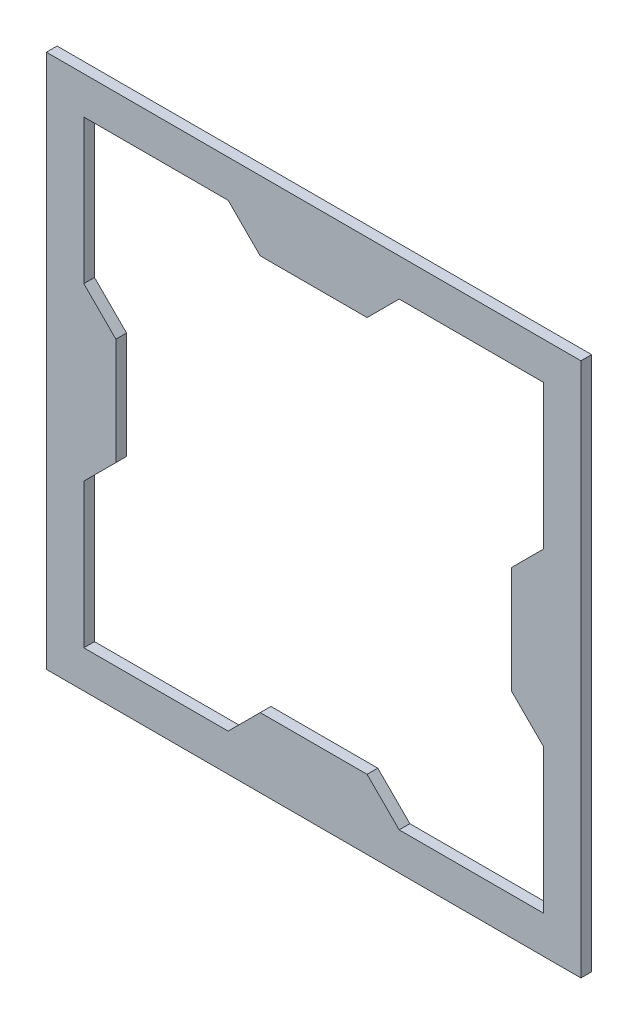
ISO-10303-21;
HEADER;
FILE_DESCRIPTION(('STEP AP214'),'2;1');
FILE_NAME('part.step','',(''),(''),'','','');
FILE_SCHEMA(('AUTOMOTIVE_DESIGN { 1 0 10303 214 1 1 1 1 }'));
ENDSEC;
DATA;
#1=APPLICATION_CONTEXT('core data for automotive mechanical design processes');
#2=APPLICATION_PROTOCOL_DEFINITION('international standard','automotive_design',2000,#1);
#3=PRODUCT_CONTEXT('',#1,'mechanical');
#4=PRODUCT('Part','Part','',(#3));
#5=PRODUCT_RELATED_PRODUCT_CATEGORY('part','',(#4));
#6=PRODUCT_DEFINITION_FORMATION('','',#4);
#7=PRODUCT_DEFINITION_CONTEXT('part definition',#1,'design');
#8=PRODUCT_DEFINITION('design','',#6,#7);
#9=PRODUCT_DEFINITION_SHAPE('','',#8);
#10=(LENGTH_UNIT() NAMED_UNIT(*) SI_UNIT(.MILLI.,.METRE.));
#11=(NAMED_UNIT(*) PLANE_ANGLE_UNIT() SI_UNIT($,.RADIAN.));
#12=(NAMED_UNIT(*) SI_UNIT($,.STERADIAN.) SOLID_ANGLE_UNIT());
#13=UNCERTAINTY_MEASURE_WITH_UNIT(LENGTH_MEASURE(1.E-05),#10,'distance_accuracy_value','');
#14=(GEOMETRIC_REPRESENTATION_CONTEXT(3) GLOBAL_UNCERTAINTY_ASSIGNED_CONTEXT((#13)) GLOBAL_UNIT_ASSIGNED_CONTEXT((#10,
#11,#12)) REPRESENTATION_CONTEXT('',''));
#15=CARTESIAN_POINT('',(0.,0.,0.));
#16=DIRECTION('',(0.,0.,1.));
#17=DIRECTION('',(1.,0.,0.));
#18=AXIS2_PLACEMENT_3D('',#15,#16,#17);
#19=CARTESIAN_POINT('',(0.,-68.2625,3.175));
#20=DIRECTION('',(0.,-1.,0.));
#21=DIRECTION('',(0.,0.,-1.));
#22=AXIS2_PLACEMENT_3D('',#19,#20,#21);
#23=PLANE('',#22);
#24=DIRECTION('',(-1.,0.,0.));
#25=VECTOR('',#24,1.);
#26=CARTESIAN_POINT('',(0.,-68.2625,0.));
#27=LINE('',#26,#25);
#28=CARTESIAN_POINT('',(68.2625,-68.2625,0.));
#29=VERTEX_POINT('',#28);
#30=CARTESIAN_POINT('',(25.3999999999993,-68.2625,0.));
#31=VERTEX_POINT('',#30);
#32=EDGE_CURVE('E241',#29,#31,#27,.T.);
#33=ORIENTED_EDGE('',*,*,#32,.T.);
#34=DIRECTION('',(0.,0.,-1.));
#35=VECTOR('',#34,1.);
#36=CARTESIAN_POINT('',(25.3999999999993,-68.2625,3.175));
#37=LINE('',#36,#35);
#38=CARTESIAN_POINT('',(25.3999999999993,-68.2625,3.175));
#39=VERTEX_POINT('',#38);
#40=EDGE_CURVE('E11',#39,#31,#37,.T.);
#41=ORIENTED_EDGE('',*,*,#40,.F.);
#42=DIRECTION('',(-1.,0.,0.));
#43=VECTOR('',#42,1.);
#44=CARTESIAN_POINT('',(0.,-68.2625,3.175));
#45=LINE('',#44,#43);
#46=CARTESIAN_POINT('',(68.2625,-68.2625,3.175));
#47=VERTEX_POINT('',#46);
#48=EDGE_CURVE('E348',#47,#39,#45,.T.);
#49=ORIENTED_EDGE('',*,*,#48,.F.);
#50=DIRECTION('',(0.,0.,-1.));
#51=VECTOR('',#50,1.);
#52=CARTESIAN_POINT('',(68.2625,-68.2625,3.175));
#53=LINE('',#52,#51);
#54=EDGE_CURVE('E51',#47,#29,#53,.T.);
#55=ORIENTED_EDGE('',*,*,#54,.T.);
#56=EDGE_LOOP('',(#33,#41,#49,#55));
#57=FACE_BOUND('',#56,.T.);
#58=ADVANCED_FACE('F32',(#57),#23,.F.);
#59=CARTESIAN_POINT('',(-21.4312500000002,-21.4312499999999,3.175));
#60=DIRECTION('',(-0.707106781186552,-0.707106781186543,0.));
#61=DIRECTION('',(0.707106781186543,-0.707106781186552,0.));
#62=AXIS2_PLACEMENT_3D('',#59,#60,#61);
#63=PLANE('',#62);
#64=DIRECTION('',(-0.707106781186543,0.707106781186552,0.));
#65=VECTOR('',#64,1.);
#66=CARTESIAN_POINT('',(-21.4312500000002,-21.4312499999999,0.));
#67=LINE('',#66,#65);
#68=CARTESIAN_POINT('',(15.8749999999995,-58.7375,0.));
#69=VERTEX_POINT('',#68);
#70=EDGE_CURVE('E243',#31,#69,#67,.T.);
#71=ORIENTED_EDGE('',*,*,#70,.T.);
#72=DIRECTION('',(0.,0.,-1.));
#73=VECTOR('',#72,1.);
#74=CARTESIAN_POINT('',(15.8749999999995,-58.7375,3.175));
#75=LINE('',#74,#73);
#76=CARTESIAN_POINT('',(15.8749999999995,-58.7375,3.175));
#77=VERTEX_POINT('',#76);
#78=EDGE_CURVE('E42',#77,#69,#75,.T.);
#79=ORIENTED_EDGE('',*,*,#78,.F.);
#80=DIRECTION('',(-0.707106781186543,0.707106781186552,0.));
#81=VECTOR('',#80,1.);
#82=CARTESIAN_POINT('',(-21.4312500000002,-21.4312499999999,3.175));
#83=LINE('',#82,#81);
#84=EDGE_CURVE('E351',#39,#77,#83,.T.);
#85=ORIENTED_EDGE('',*,*,#84,.F.);
#86=ORIENTED_EDGE('',*,*,#40,.T.);
#87=EDGE_LOOP('',(#71,#79,#85,#86));
#88=FACE_BOUND('',#87,.T.);
#89=ADVANCED_FACE('F388',(#88),#63,.F.);
#90=CARTESIAN_POINT('',(0.,-58.7375,3.175));
#91=DIRECTION('',(0.,-1.,0.));
#92=DIRECTION('',(0.,0.,-1.));
#93=AXIS2_PLACEMENT_3D('',#90,#91,#92);
#94=PLANE('',#93);
#95=DIRECTION('',(-1.,0.,0.));
#96=VECTOR('',#95,1.);
#97=CARTESIAN_POINT('',(0.,-58.7375,0.));
#98=LINE('',#97,#96);
#99=CARTESIAN_POINT('',(-15.8750000000005,-58.7375,0.));
#100=VERTEX_POINT('',#99);
#101=EDGE_CURVE('E246',#69,#100,#98,.T.);
#102=ORIENTED_EDGE('',*,*,#101,.T.);
#103=DIRECTION('',(0.,0.,-1.));
#104=VECTOR('',#103,1.);
#105=CARTESIAN_POINT('',(-15.8750000000005,-58.7375,3.175));
#106=LINE('',#105,#104);
#107=CARTESIAN_POINT('',(-15.8750000000005,-58.7375,3.175));
#108=VERTEX_POINT('',#107);
#109=EDGE_CURVE('E317',#108,#100,#106,.T.);
#110=ORIENTED_EDGE('',*,*,#109,.F.);
#111=DIRECTION('',(-1.,0.,0.));
#112=VECTOR('',#111,1.);
#113=CARTESIAN_POINT('',(0.,-58.7375,3.175));
#114=LINE('',#113,#112);
#115=EDGE_CURVE('E358',#77,#108,#114,.T.);
#116=ORIENTED_EDGE('',*,*,#115,.F.);
#117=ORIENTED_EDGE('',*,*,#78,.T.);
#118=EDGE_LOOP('',(#102,#110,#116,#117));
#119=FACE_BOUND('',#118,.T.);
#120=ADVANCED_FACE('F393',(#119),#94,.F.);
#121=CARTESIAN_POINT('',(21.4312499999999,-21.4312500000002,3.175));
#122=DIRECTION('',(0.707106781186542,-0.707106781186553,0.));
#123=DIRECTION('',(0.707106781186553,0.707106781186542,0.));
#124=AXIS2_PLACEMENT_3D('',#121,#122,#123);
#125=PLANE('',#124);
#126=DIRECTION('',(-0.707106781186553,-0.707106781186542,0.));
#127=VECTOR('',#126,1.);
#128=CARTESIAN_POINT('',(21.4312499999999,-21.4312500000002,0.));
#129=LINE('',#128,#127);
#130=CARTESIAN_POINT('',(-25.4000000000006,-68.2625,0.));
#131=VERTEX_POINT('',#130);
#132=EDGE_CURVE('E248',#100,#131,#129,.T.);
#133=ORIENTED_EDGE('',*,*,#132,.T.);
#134=DIRECTION('',(0.,0.,-1.));
#135=VECTOR('',#134,1.);
#136=CARTESIAN_POINT('',(-25.4000000000006,-68.2625,3.175));
#137=LINE('',#136,#135);
#138=CARTESIAN_POINT('',(-25.4000000000006,-68.2625,3.175));
#139=VERTEX_POINT('',#138);
#140=EDGE_CURVE('E314',#139,#131,#137,.T.);
#141=ORIENTED_EDGE('',*,*,#140,.F.);
#142=DIRECTION('',(-0.707106781186553,-0.707106781186542,0.));
#143=VECTOR('',#142,1.);
#144=CARTESIAN_POINT('',(21.4312499999999,-21.4312500000002,3.175));
#145=LINE('',#144,#143);
#146=EDGE_CURVE('E360',#108,#139,#145,.T.);
#147=ORIENTED_EDGE('',*,*,#146,.F.);
#148=ORIENTED_EDGE('',*,*,#109,.T.);
#149=EDGE_LOOP('',(#133,#141,#147,#148));
#150=FACE_BOUND('',#149,.T.);
#151=ADVANCED_FACE('F399',(#150),#125,.F.);
#152=CARTESIAN_POINT('',(-68.2625,-68.2625,0.));
#153=VERTEX_POINT('',#152);
#154=EDGE_CURVE('E244',#131,#153,#27,.T.);
#155=ORIENTED_EDGE('',*,*,#154,.T.);
#156=DIRECTION('',(0.,0.,-1.));
#157=VECTOR('',#156,1.);
#158=CARTESIAN_POINT('',(-68.2625,-68.2625,3.175));
#159=LINE('',#158,#157);
#160=CARTESIAN_POINT('',(-68.2625,-68.2625,3.175));
#161=VERTEX_POINT('',#160);
#162=EDGE_CURVE('E311',#161,#153,#159,.T.);
#163=ORIENTED_EDGE('',*,*,#162,.F.);
#164=EDGE_CURVE('E353',#139,#161,#45,.T.);
#165=ORIENTED_EDGE('',*,*,#164,.F.);
#166=ORIENTED_EDGE('',*,*,#140,.T.);
#167=EDGE_LOOP('',(#155,#163,#165,#166));
#168=FACE_BOUND('',#167,.T.);
#169=ADVANCED_FACE('F403',(#168),#23,.F.);
#170=CARTESIAN_POINT('',(-68.2625,0.,3.175));
#171=DIRECTION('',(-1.,0.,0.));
#172=DIRECTION('',(0.,0.,1.));
#173=AXIS2_PLACEMENT_3D('',#170,#171,#172);
#174=PLANE('',#173);
#175=DIRECTION('',(0.,1.,0.));
#176=VECTOR('',#175,1.);
#177=CARTESIAN_POINT('',(-68.2625,0.,0.));
#178=LINE('',#177,#176);
#179=CARTESIAN_POINT('',(-68.2625,-25.399999999999,0.));
#180=VERTEX_POINT('',#179);
#181=EDGE_CURVE('E250',#153,#180,#178,.T.);
#182=ORIENTED_EDGE('',*,*,#181,.T.);
#183=DIRECTION('',(0.,0.,-1.));
#184=VECTOR('',#183,1.);
#185=CARTESIAN_POINT('',(-68.2625,-25.399999999999,3.175));
#186=LINE('',#185,#184);
#187=CARTESIAN_POINT('',(-68.2625,-25.399999999999,3.175));
#188=VERTEX_POINT('',#187);
#189=EDGE_CURVE('E308',#188,#180,#186,.T.);
#190=ORIENTED_EDGE('',*,*,#189,.F.);
#191=DIRECTION('',(0.,1.,0.));
#192=VECTOR('',#191,1.);
#193=CARTESIAN_POINT('',(-68.2625,0.,3.175));
#194=LINE('',#193,#192);
#195=EDGE_CURVE('E362',#161,#188,#194,.T.);
#196=ORIENTED_EDGE('',*,*,#195,.F.);
#197=ORIENTED_EDGE('',*,*,#162,.T.);
#198=EDGE_LOOP('',(#182,#190,#196,#197));
#199=FACE_BOUND('',#198,.T.);
#200=ADVANCED_FACE('F408',(#199),#174,.F.);
#201=CARTESIAN_POINT('',(-21.4312499999998,21.4312500000002,3.175));
#202=DIRECTION('',(-0.707106781186541,0.707106781186554,0.));
#203=DIRECTION('',(-0.707106781186554,-0.707106781186541,0.));
#204=AXIS2_PLACEMENT_3D('',#201,#202,#203);
#205=PLANE('',#204);
#206=DIRECTION('',(0.707106781186554,0.707106781186541,0.));
#207=VECTOR('',#206,1.);
#208=CARTESIAN_POINT('',(-21.4312499999998,21.4312500000002,0.));
#209=LINE('',#208,#207);
#210=CARTESIAN_POINT('',(-58.7375,-15.8749999999992,0.));
#211=VERTEX_POINT('',#210);
#212=EDGE_CURVE('E252',#180,#211,#209,.T.);
#213=ORIENTED_EDGE('',*,*,#212,.T.);
#214=DIRECTION('',(0.,0.,-1.));
#215=VECTOR('',#214,1.);
#216=CARTESIAN_POINT('',(-58.7375,-15.8749999999992,3.175));
#217=LINE('',#216,#215);
#218=CARTESIAN_POINT('',(-58.7375,-15.8749999999992,3.175));
#219=VERTEX_POINT('',#218);
#220=EDGE_CURVE('E305',#219,#211,#217,.T.);
#221=ORIENTED_EDGE('',*,*,#220,.F.);
#222=DIRECTION('',(0.707106781186554,0.707106781186541,0.));
#223=VECTOR('',#222,1.);
#224=CARTESIAN_POINT('',(-21.4312499999998,21.4312500000002,3.175));
#225=LINE('',#224,#223);
#226=EDGE_CURVE('E364',#188,#219,#225,.T.);
#227=ORIENTED_EDGE('',*,*,#226,.F.);
#228=ORIENTED_EDGE('',*,*,#189,.T.);
#229=EDGE_LOOP('',(#213,#221,#227,#228));
#230=FACE_BOUND('',#229,.T.);
#231=ADVANCED_FACE('F414',(#230),#205,.F.);
#232=CARTESIAN_POINT('',(-58.7375,0.,3.175));
#233=DIRECTION('',(-1.,0.,0.));
#234=DIRECTION('',(0.,0.,1.));
#235=AXIS2_PLACEMENT_3D('',#232,#233,#234);
#236=PLANE('',#235);
#237=DIRECTION('',(0.,1.,0.));
#238=VECTOR('',#237,1.);
#239=CARTESIAN_POINT('',(-58.7375,0.,0.));
#240=LINE('',#239,#238);
#241=CARTESIAN_POINT('',(-58.7375,15.8750000000007,0.));
#242=VERTEX_POINT('',#241);
#243=EDGE_CURVE('E255',#211,#242,#240,.T.);
#244=ORIENTED_EDGE('',*,*,#243,.T.);
#245=DIRECTION('',(0.,0.,-1.));
#246=VECTOR('',#245,1.);
#247=CARTESIAN_POINT('',(-58.7375,15.8750000000007,3.175));
#248=LINE('',#247,#246);
#249=CARTESIAN_POINT('',(-58.7375,15.8750000000007,3.175));
#250=VERTEX_POINT('',#249);
#251=EDGE_CURVE('E302',#250,#242,#248,.T.);
#252=ORIENTED_EDGE('',*,*,#251,.F.);
#253=DIRECTION('',(0.,1.,0.));
#254=VECTOR('',#253,1.);
#255=CARTESIAN_POINT('',(-58.7375,0.,3.175));
#256=LINE('',#255,#254);
#257=EDGE_CURVE('E367',#219,#250,#256,.T.);
#258=ORIENTED_EDGE('',*,*,#257,.F.);
#259=ORIENTED_EDGE('',*,*,#220,.T.);
#260=EDGE_LOOP('',(#244,#252,#258,#259));
#261=FACE_BOUND('',#260,.T.);
#262=ADVANCED_FACE('F418',(#261),#236,.F.);
#263=CARTESIAN_POINT('',(-21.4312500000003,-21.4312499999998,3.175));
#264=DIRECTION('',(-0.707106781186555,-0.70710678118654,0.));
#265=DIRECTION('',(0.70710678118654,-0.707106781186555,0.));
#266=AXIS2_PLACEMENT_3D('',#263,#264,#265);
#267=PLANE('',#266);
#268=DIRECTION('',(-0.70710678118654,0.707106781186555,0.));
#269=VECTOR('',#268,1.);
#270=CARTESIAN_POINT('',(-21.4312500000003,-21.4312499999998,0.));
#271=LINE('',#270,#269);
#272=CARTESIAN_POINT('',(-68.2625,25.4000000000009,0.));
#273=VERTEX_POINT('',#272);
#274=EDGE_CURVE('E257',#242,#273,#271,.T.);
#275=ORIENTED_EDGE('',*,*,#274,.T.);
#276=DIRECTION('',(0.,0.,-1.));
#277=VECTOR('',#276,1.);
#278=CARTESIAN_POINT('',(-68.2625,25.4000000000009,3.175));
#279=LINE('',#278,#277);
#280=CARTESIAN_POINT('',(-68.2625,25.4000000000009,3.175));
#281=VERTEX_POINT('',#280);
#282=EDGE_CURVE('E299',#281,#273,#279,.T.);
#283=ORIENTED_EDGE('',*,*,#282,.F.);
#284=DIRECTION('',(-0.70710678118654,0.707106781186555,0.));
#285=VECTOR('',#284,1.);
#286=CARTESIAN_POINT('',(-21.4312500000003,-21.4312499999998,3.175));
#287=LINE('',#286,#285);
#288=EDGE_CURVE('E369',#250,#281,#287,.T.);
#289=ORIENTED_EDGE('',*,*,#288,.F.);
#290=ORIENTED_EDGE('',*,*,#251,.T.);
#291=EDGE_LOOP('',(#275,#283,#289,#290));
#292=FACE_BOUND('',#291,.T.);
#293=ADVANCED_FACE('F423',(#292),#267,.F.);
#294=CARTESIAN_POINT('',(-68.2625,68.2625,0.));
#295=VERTEX_POINT('',#294);
#296=EDGE_CURVE('E253',#273,#295,#178,.T.);
#297=ORIENTED_EDGE('',*,*,#296,.T.);
#298=DIRECTION('',(0.,0.,-1.));
#299=VECTOR('',#298,1.);
#300=CARTESIAN_POINT('',(-68.2625,68.2625,3.175));
#301=LINE('',#300,#299);
#302=CARTESIAN_POINT('',(-68.2625,68.2625,3.175));
#303=VERTEX_POINT('',#302);
#304=EDGE_CURVE('E297',#303,#295,#301,.T.);
#305=ORIENTED_EDGE('',*,*,#304,.F.);
#306=EDGE_CURVE('E365',#281,#303,#194,.T.);
#307=ORIENTED_EDGE('',*,*,#306,.F.);
#308=ORIENTED_EDGE('',*,*,#282,.T.);
#309=EDGE_LOOP('',(#297,#305,#307,#308));
#310=FACE_BOUND('',#309,.T.);
#311=ADVANCED_FACE('F429',(#310),#174,.F.);
#312=CARTESIAN_POINT('',(0.,68.2625,3.175));
#313=DIRECTION('',(0.,-1.,0.));
#314=DIRECTION('',(0.,0.,-1.));
#315=AXIS2_PLACEMENT_3D('',#312,#313,#314);
#316=PLANE('',#315);
#317=DIRECTION('',(-1.,0.,0.));
#318=VECTOR('',#317,1.);
#319=CARTESIAN_POINT('',(0.,68.2625,0.));
#320=LINE('',#319,#318);
#321=CARTESIAN_POINT('',(-25.4,68.2625,0.));
#322=VERTEX_POINT('',#321);
#323=EDGE_CURVE('E259',#322,#295,#320,.T.);
#324=ORIENTED_EDGE('',*,*,#323,.F.);
#325=DIRECTION('',(0.,0.,-1.));
#326=VECTOR('',#325,1.);
#327=CARTESIAN_POINT('',(-25.4,68.2625,3.175));
#328=LINE('',#327,#326);
#329=CARTESIAN_POINT('',(-25.4,68.2625,3.175));
#330=VERTEX_POINT('',#329);
#331=EDGE_CURVE('E295',#330,#322,#328,.T.);
#332=ORIENTED_EDGE('',*,*,#331,.F.);
#333=DIRECTION('',(-1.,0.,0.));
#334=VECTOR('',#333,1.);
#335=CARTESIAN_POINT('',(0.,68.2625,3.175));
#336=LINE('',#335,#334);
#337=EDGE_CURVE('E371',#330,#303,#336,.T.);
#338=ORIENTED_EDGE('',*,*,#337,.T.);
#339=ORIENTED_EDGE('',*,*,#304,.T.);
#340=EDGE_LOOP('',(#324,#332,#338,#339));
#341=FACE_BOUND('',#340,.T.);
#342=ADVANCED_FACE('F433',(#341),#316,.T.);
#343=CARTESIAN_POINT('',(21.43125,21.43125,3.175));
#344=DIRECTION('',(0.707106781186547,0.707106781186548,0.));
#345=DIRECTION('',(-0.707106781186548,0.707106781186547,0.));
#346=AXIS2_PLACEMENT_3D('',#343,#344,#345);
#347=PLANE('',#346);
#348=DIRECTION('',(0.707106781186548,-0.707106781186547,0.));
#349=VECTOR('',#348,1.);
#350=CARTESIAN_POINT('',(21.43125,21.43125,0.));
#351=LINE('',#350,#349);
#352=CARTESIAN_POINT('',(-15.875,58.7375,0.));
#353=VERTEX_POINT('',#352);
#354=EDGE_CURVE('E262',#322,#353,#351,.T.);
#355=ORIENTED_EDGE('',*,*,#354,.T.);
#356=DIRECTION('',(0.,0.,-1.));
#357=VECTOR('',#356,1.);
#358=CARTESIAN_POINT('',(-15.875,58.7375,3.175));
#359=LINE('',#358,#357);
#360=CARTESIAN_POINT('',(-15.875,58.7375,3.175));
#361=VERTEX_POINT('',#360);
#362=EDGE_CURVE('E293',#361,#353,#359,.T.);
#363=ORIENTED_EDGE('',*,*,#362,.F.);
#364=DIRECTION('',(0.707106781186548,-0.707106781186547,0.));
#365=VECTOR('',#364,1.);
#366=CARTESIAN_POINT('',(21.43125,21.43125,3.175));
#367=LINE('',#366,#365);
#368=EDGE_CURVE('E374',#330,#361,#367,.T.);
#369=ORIENTED_EDGE('',*,*,#368,.F.);
#370=ORIENTED_EDGE('',*,*,#331,.T.);
#371=EDGE_LOOP('',(#355,#363,#369,#370));
#372=FACE_BOUND('',#371,.T.);
#373=ADVANCED_FACE('F438',(#372),#347,.F.);
#374=CARTESIAN_POINT('',(0.,58.7375,3.175));
#375=DIRECTION('',(0.,-1.,0.));
#376=DIRECTION('',(0.,0.,-1.));
#377=AXIS2_PLACEMENT_3D('',#374,#375,#376);
#378=PLANE('',#377);
#379=DIRECTION('',(-1.,0.,0.));
#380=VECTOR('',#379,1.);
#381=CARTESIAN_POINT('',(0.,58.7375,0.));
#382=LINE('',#381,#380);
#383=CARTESIAN_POINT('',(15.875,58.7375,0.));
#384=VERTEX_POINT('',#383);
#385=EDGE_CURVE('E266',#384,#353,#382,.T.);
#386=ORIENTED_EDGE('',*,*,#385,.F.);
#387=DIRECTION('',(0.,0.,-1.));
#388=VECTOR('',#387,1.);
#389=CARTESIAN_POINT('',(15.875,58.7375,3.175));
#390=LINE('',#389,#388);
#391=CARTESIAN_POINT('',(15.875,58.7375,3.175));
#392=VERTEX_POINT('',#391);
#393=EDGE_CURVE('E291',#392,#384,#390,.T.);
#394=ORIENTED_EDGE('',*,*,#393,.F.);
#395=DIRECTION('',(-1.,0.,0.));
#396=VECTOR('',#395,1.);
#397=CARTESIAN_POINT('',(0.,58.7375,3.175));
#398=LINE('',#397,#396);
#399=EDGE_CURVE('E377',#392,#361,#398,.T.);
#400=ORIENTED_EDGE('',*,*,#399,.T.);
#401=ORIENTED_EDGE('',*,*,#362,.T.);
#402=EDGE_LOOP('',(#386,#394,#400,#401));
#403=FACE_BOUND('',#402,.T.);
#404=ADVANCED_FACE('F445',(#403),#378,.T.);
#405=CARTESIAN_POINT('',(-21.43125,21.43125,3.175));
#406=DIRECTION('',(-0.707106781186547,0.707106781186548,0.));
#407=DIRECTION('',(-0.707106781186548,-0.707106781186547,0.));
#408=AXIS2_PLACEMENT_3D('',#405,#406,#407);
#409=PLANE('',#408);
#410=DIRECTION('',(0.707106781186548,0.707106781186547,0.));
#411=VECTOR('',#410,1.);
#412=CARTESIAN_POINT('',(-21.43125,21.43125,0.));
#413=LINE('',#412,#411);
#414=CARTESIAN_POINT('',(25.4,68.2625,0.));
#415=VERTEX_POINT('',#414);
#416=EDGE_CURVE('E269',#384,#415,#413,.T.);
#417=ORIENTED_EDGE('',*,*,#416,.T.);
#418=DIRECTION('',(0.,0.,-1.));
#419=VECTOR('',#418,1.);
#420=CARTESIAN_POINT('',(25.4,68.2625,3.175));
#421=LINE('',#420,#419);
#422=CARTESIAN_POINT('',(25.4,68.2625,3.175));
#423=VERTEX_POINT('',#422);
#424=EDGE_CURVE('E289',#423,#415,#421,.T.);
#425=ORIENTED_EDGE('',*,*,#424,.F.);
#426=DIRECTION('',(0.707106781186548,0.707106781186547,0.));
#427=VECTOR('',#426,1.);
#428=CARTESIAN_POINT('',(-21.43125,21.43125,3.175));
#429=LINE('',#428,#427);
#430=EDGE_CURVE('E380',#392,#423,#429,.T.);
#431=ORIENTED_EDGE('',*,*,#430,.F.);
#432=ORIENTED_EDGE('',*,*,#393,.T.);
#433=EDGE_LOOP('',(#417,#425,#431,#432));
#434=FACE_BOUND('',#433,.T.);
#435=ADVANCED_FACE('F448',(#434),#409,.F.);
#436=CARTESIAN_POINT('',(68.2625,68.2625,0.));
#437=VERTEX_POINT('',#436);
#438=EDGE_CURVE('E263',#437,#415,#320,.T.);
#439=ORIENTED_EDGE('',*,*,#438,.F.);
#440=DIRECTION('',(0.,0.,-1.));
#441=VECTOR('',#440,1.);
#442=CARTESIAN_POINT('',(68.2625,68.2625,3.175));
#443=LINE('',#442,#441);
#444=CARTESIAN_POINT('',(68.2625,68.2625,3.175));
#445=VERTEX_POINT('',#444);
#446=EDGE_CURVE('E287',#445,#437,#443,.T.);
#447=ORIENTED_EDGE('',*,*,#446,.F.);
#448=EDGE_CURVE('E375',#445,#423,#336,.T.);
#449=ORIENTED_EDGE('',*,*,#448,.T.);
#450=ORIENTED_EDGE('',*,*,#424,.T.);
#451=EDGE_LOOP('',(#439,#447,#449,#450));
#452=FACE_BOUND('',#451,.T.);
#453=ADVANCED_FACE('F452',(#452),#316,.T.);
#454=CARTESIAN_POINT('',(68.2625,0.,3.175));
#455=DIRECTION('',(-1.,0.,0.));
#456=DIRECTION('',(0.,0.,1.));
#457=AXIS2_PLACEMENT_3D('',#454,#455,#456);
#458=PLANE('',#457);
#459=DIRECTION('',(0.,1.,0.));
#460=VECTOR('',#459,1.);
#461=CARTESIAN_POINT('',(68.2625,0.,0.));
#462=LINE('',#461,#460);
#463=CARTESIAN_POINT('',(68.2625,25.3999999999997,0.));
#464=VERTEX_POINT('',#463);
#465=EDGE_CURVE('E272',#464,#437,#462,.T.);
#466=ORIENTED_EDGE('',*,*,#465,.F.);
#467=DIRECTION('',(0.,0.,-1.));
#468=VECTOR('',#467,1.);
#469=CARTESIAN_POINT('',(68.2625,25.3999999999997,3.175));
#470=LINE('',#469,#468);
#471=CARTESIAN_POINT('',(68.2625,25.3999999999997,3.175));
#472=VERTEX_POINT('',#471);
#473=EDGE_CURVE('E285',#472,#464,#470,.T.);
#474=ORIENTED_EDGE('',*,*,#473,.F.);
#475=DIRECTION('',(0.,1.,0.));
#476=VECTOR('',#475,1.);
#477=CARTESIAN_POINT('',(68.2625,0.,3.175));
#478=LINE('',#477,#476);
#479=EDGE_CURVE('E226',#472,#445,#478,.T.);
#480=ORIENTED_EDGE('',*,*,#479,.T.);
#481=ORIENTED_EDGE('',*,*,#446,.T.);
#482=EDGE_LOOP('',(#466,#474,#480,#481));
#483=FACE_BOUND('',#482,.T.);
#484=ADVANCED_FACE('F454',(#483),#458,.T.);
#485=CARTESIAN_POINT('',(21.43125,-21.4312500000001,3.175));
#486=DIRECTION('',(0.707106781186545,-0.707106781186549,0.));
#487=DIRECTION('',(0.70710678118655,0.707106781186545,0.));
#488=AXIS2_PLACEMENT_3D('',#485,#486,#487);
#489=PLANE('',#488);
#490=DIRECTION('',(-0.70710678118655,-0.707106781186546,0.));
#491=VECTOR('',#490,1.);
#492=CARTESIAN_POINT('',(21.43125,-21.4312500000001,0.));
#493=LINE('',#492,#491);
#494=CARTESIAN_POINT('',(58.7375000000001,15.8749999999998,0.));
#495=VERTEX_POINT('',#494);
#496=EDGE_CURVE('E275',#464,#495,#493,.T.);
#497=ORIENTED_EDGE('',*,*,#496,.T.);
#498=DIRECTION('',(0.,0.,-1.));
#499=VECTOR('',#498,1.);
#500=CARTESIAN_POINT('',(58.7375000000001,15.8749999999998,3.175));
#501=LINE('',#500,#499);
#502=CARTESIAN_POINT('',(58.7375000000001,15.8749999999998,3.175));
#503=VERTEX_POINT('',#502);
#504=EDGE_CURVE('E211',#503,#495,#501,.T.);
#505=ORIENTED_EDGE('',*,*,#504,.F.);
#506=DIRECTION('',(-0.70710678118655,-0.707106781186546,0.));
#507=VECTOR('',#506,1.);
#508=CARTESIAN_POINT('',(21.43125,-21.4312500000001,3.175));
#509=LINE('',#508,#507);
#510=EDGE_CURVE('E223',#472,#503,#509,.T.);
#511=ORIENTED_EDGE('',*,*,#510,.F.);
#512=ORIENTED_EDGE('',*,*,#473,.T.);
#513=EDGE_LOOP('',(#497,#505,#511,#512));
#514=FACE_BOUND('',#513,.T.);
#515=ADVANCED_FACE('F457',(#514),#489,.F.);
#516=CARTESIAN_POINT('',(58.7375,0.,3.175));
#517=DIRECTION('',(-1.,0.,0.));
#518=DIRECTION('',(0.,0.,1.));
#519=AXIS2_PLACEMENT_3D('',#516,#517,#518);
#520=PLANE('',#519);
#521=DIRECTION('',(0.,1.,0.));
#522=VECTOR('',#521,1.);
#523=CARTESIAN_POINT('',(58.7375,0.,0.));
#524=LINE('',#523,#522);
#525=CARTESIAN_POINT('',(58.7375,-15.8750000000003,0.));
#526=VERTEX_POINT('',#525);
#527=EDGE_CURVE('E208',#526,#495,#524,.T.);
#528=ORIENTED_EDGE('',*,*,#527,.F.);
#529=DIRECTION('',(0.,0.,-1.));
#530=VECTOR('',#529,1.);
#531=CARTESIAN_POINT('',(58.7375,-15.8750000000003,3.175));
#532=LINE('',#531,#530);
#533=CARTESIAN_POINT('',(58.7375,-15.8750000000003,3.175));
#534=VERTEX_POINT('',#533);
#535=EDGE_CURVE('E202',#534,#526,#532,.T.);
#536=ORIENTED_EDGE('',*,*,#535,.F.);
#537=DIRECTION('',(0.,1.,0.));
#538=VECTOR('',#537,1.);
#539=CARTESIAN_POINT('',(58.7375,0.,3.175));
#540=LINE('',#539,#538);
#541=EDGE_CURVE('E206',#534,#503,#540,.T.);
#542=ORIENTED_EDGE('',*,*,#541,.T.);
#543=ORIENTED_EDGE('',*,*,#504,.T.);
#544=EDGE_LOOP('',(#528,#536,#542,#543));
#545=FACE_BOUND('',#544,.T.);
#546=ADVANCED_FACE('F204',(#545),#520,.T.);
#547=CARTESIAN_POINT('',(21.4312500000001,21.4312499999999,3.175));
#548=DIRECTION('',(0.70710678118655,0.707106781186545,0.));
#549=DIRECTION('',(-0.707106781186545,0.70710678118655,0.));
#550=AXIS2_PLACEMENT_3D('',#547,#548,#549);
#551=PLANE('',#550);
#552=DIRECTION('',(0.707106781186545,-0.70710678118655,0.));
#553=VECTOR('',#552,1.);
#554=CARTESIAN_POINT('',(21.4312500000001,21.4312499999999,0.));
#555=LINE('',#554,#553);
#556=CARTESIAN_POINT('',(68.2625,-25.4000000000003,0.));
#557=VERTEX_POINT('',#556);
#558=EDGE_CURVE('E280',#526,#557,#555,.T.);
#559=ORIENTED_EDGE('',*,*,#558,.T.);
#560=DIRECTION('',(0.,0.,-1.));
#561=VECTOR('',#560,1.);
#562=CARTESIAN_POINT('',(68.2625,-25.4000000000003,3.175));
#563=LINE('',#562,#561);
#564=CARTESIAN_POINT('',(68.2625,-25.4000000000003,3.175));
#565=VERTEX_POINT('',#564);
#566=EDGE_CURVE('E126',#565,#557,#563,.T.);
#567=ORIENTED_EDGE('',*,*,#566,.F.);
#568=DIRECTION('',(0.707106781186545,-0.70710678118655,0.));
#569=VECTOR('',#568,1.);
#570=CARTESIAN_POINT('',(21.4312500000001,21.4312499999999,3.175));
#571=LINE('',#570,#569);
#572=EDGE_CURVE('E213',#534,#565,#571,.T.);
#573=ORIENTED_EDGE('',*,*,#572,.F.);
#574=ORIENTED_EDGE('',*,*,#535,.T.);
#575=EDGE_LOOP('',(#559,#567,#573,#574));
#576=FACE_BOUND('',#575,.T.);
#577=ADVANCED_FACE('F214',(#576),#551,.F.);
#578=CARTESIAN_POINT('',(-79.375,0.,3.175));
#579=DIRECTION('',(-1.,0.,0.));
#580=DIRECTION('',(0.,0.,1.));
#581=AXIS2_PLACEMENT_3D('',#578,#579,#580);
#582=PLANE('',#581);
#583=DIRECTION('',(0.,1.,0.));
#584=VECTOR('',#583,1.);
#585=CARTESIAN_POINT('',(-79.375,0.,0.));
#586=LINE('',#585,#584);
#587=CARTESIAN_POINT('',(-79.375,-79.375,0.));
#588=VERTEX_POINT('',#587);
#589=CARTESIAN_POINT('',(-79.375,79.375,0.));
#590=VERTEX_POINT('',#589);
#591=EDGE_CURVE('E230',#588,#590,#586,.T.);
#592=ORIENTED_EDGE('',*,*,#591,.F.);
#593=DIRECTION('',(0.,0.,-1.));
#594=VECTOR('',#593,1.);
#595=CARTESIAN_POINT('',(-79.375,-79.375,3.175));
#596=LINE('',#595,#594);
#597=CARTESIAN_POINT('',(-79.375,-79.375,3.175));
#598=VERTEX_POINT('',#597);
#599=EDGE_CURVE('E36',#598,#588,#596,.T.);
#600=ORIENTED_EDGE('',*,*,#599,.F.);
#601=DIRECTION('',(0.,1.,0.));
#602=VECTOR('',#601,1.);
#603=CARTESIAN_POINT('',(-79.375,0.,3.175));
#604=LINE('',#603,#602);
#605=CARTESIAN_POINT('',(-79.375,79.375,3.175));
#606=VERTEX_POINT('',#605);
#607=EDGE_CURVE('E506',#598,#606,#604,.T.);
#608=ORIENTED_EDGE('',*,*,#607,.T.);
#609=DIRECTION('',(0.,0.,-1.));
#610=VECTOR('',#609,1.);
#611=CARTESIAN_POINT('',(-79.375,79.375,3.175));
#612=LINE('',#611,#610);
#613=EDGE_CURVE('E322',#606,#590,#612,.T.);
#614=ORIENTED_EDGE('',*,*,#613,.T.);
#615=EDGE_LOOP('',(#592,#600,#608,#614));
#616=FACE_BOUND('',#615,.T.);
#617=ADVANCED_FACE('F34',(#616),#582,.T.);
#618=CARTESIAN_POINT('',(0.,-79.375,3.175));
#619=DIRECTION('',(0.,-1.,0.));
#620=DIRECTION('',(1.,0.,0.));
#621=AXIS2_PLACEMENT_3D('',#618,#619,#620);
#622=PLANE('',#621);
#623=DIRECTION('',(-1.,0.,0.));
#624=VECTOR('',#623,1.);
#625=CARTESIAN_POINT('',(0.,-79.375,0.));
#626=LINE('',#625,#624);
#627=CARTESIAN_POINT('',(79.375,-79.375,0.));
#628=VERTEX_POINT('',#627);
#629=EDGE_CURVE('E233',#628,#588,#626,.T.);
#630=ORIENTED_EDGE('',*,*,#629,.F.);
#631=DIRECTION('',(0.,0.,-1.));
#632=VECTOR('',#631,1.);
#633=CARTESIAN_POINT('',(79.375,-79.375,3.175));
#634=LINE('',#633,#632);
#635=CARTESIAN_POINT('',(79.375,-79.375,3.175));
#636=VERTEX_POINT('',#635);
#637=EDGE_CURVE('E326',#636,#628,#634,.T.);
#638=ORIENTED_EDGE('',*,*,#637,.F.);
#639=DIRECTION('',(-1.,0.,0.));
#640=VECTOR('',#639,1.);
#641=CARTESIAN_POINT('',(0.,-79.375,3.175));
#642=LINE('',#641,#640);
#643=EDGE_CURVE('E335',#636,#598,#642,.T.);
#644=ORIENTED_EDGE('',*,*,#643,.T.);
#645=ORIENTED_EDGE('',*,*,#599,.T.);
#646=EDGE_LOOP('',(#630,#638,#644,#645));
#647=FACE_BOUND('',#646,.T.);
#648=ADVANCED_FACE('F333',(#647),#622,.T.);
#649=CARTESIAN_POINT('',(79.375,0.,3.175));
#650=DIRECTION('',(-1.,0.,0.));
#651=DIRECTION('',(0.,0.,1.));
#652=AXIS2_PLACEMENT_3D('',#649,#650,#651);
#653=PLANE('',#652);
#654=DIRECTION('',(0.,1.,0.));
#655=VECTOR('',#654,1.);
#656=CARTESIAN_POINT('',(79.375,0.,0.));
#657=LINE('',#656,#655);
#658=CARTESIAN_POINT('',(79.375,79.375,0.));
#659=VERTEX_POINT('',#658);
#660=EDGE_CURVE('E236',#628,#659,#657,.T.);
#661=ORIENTED_EDGE('',*,*,#660,.T.);
#662=DIRECTION('',(0.,0.,-1.));
#663=VECTOR('',#662,1.);
#664=CARTESIAN_POINT('',(79.375,79.375,3.175));
#665=LINE('',#664,#663);
#666=CARTESIAN_POINT('',(79.375,79.375,3.175));
#667=VERTEX_POINT('',#666);
#668=EDGE_CURVE('E324',#667,#659,#665,.T.);
#669=ORIENTED_EDGE('',*,*,#668,.F.);
#670=DIRECTION('',(0.,1.,0.));
#671=VECTOR('',#670,1.);
#672=CARTESIAN_POINT('',(79.375,0.,3.175));
#673=LINE('',#672,#671);
#674=EDGE_CURVE('E349',#636,#667,#673,.T.);
#675=ORIENTED_EDGE('',*,*,#674,.F.);
#676=ORIENTED_EDGE('',*,*,#637,.T.);
#677=EDGE_LOOP('',(#661,#669,#675,#676));
#678=FACE_BOUND('',#677,.T.);
#679=ADVANCED_FACE('F342',(#678),#653,.F.);
#680=CARTESIAN_POINT('',(0.,79.375,3.175));
#681=DIRECTION('',(0.,-1.,0.));
#682=DIRECTION('',(1.,0.,0.));
#683=AXIS2_PLACEMENT_3D('',#680,#681,#682);
#684=PLANE('',#683);
#685=DIRECTION('',(-1.,0.,0.));
#686=VECTOR('',#685,1.);
#687=CARTESIAN_POINT('',(0.,79.375,0.));
#688=LINE('',#687,#686);
#689=EDGE_CURVE('E238',#659,#590,#688,.T.);
#690=ORIENTED_EDGE('',*,*,#689,.T.);
#691=ORIENTED_EDGE('',*,*,#613,.F.);
#692=DIRECTION('',(-1.,0.,0.));
#693=VECTOR('',#692,1.);
#694=CARTESIAN_POINT('',(0.,79.375,3.175));
#695=LINE('',#694,#693);
#696=EDGE_CURVE('E346',#667,#606,#695,.T.);
#697=ORIENTED_EDGE('',*,*,#696,.F.);
#698=ORIENTED_EDGE('',*,*,#668,.T.);
#699=EDGE_LOOP('',(#690,#691,#697,#698));
#700=FACE_BOUND('',#699,.T.);
#701=ADVANCED_FACE('F345',(#700),#684,.F.);
#702=EDGE_CURVE('E276',#29,#557,#462,.T.);
#703=ORIENTED_EDGE('',*,*,#702,.F.);
#704=ORIENTED_EDGE('',*,*,#54,.F.);
#705=EDGE_CURVE('E217',#47,#565,#478,.T.);
#706=ORIENTED_EDGE('',*,*,#705,.T.);
#707=ORIENTED_EDGE('',*,*,#566,.T.);
#708=EDGE_LOOP('',(#703,#704,#706,#707));
#709=FACE_BOUND('',#708,.T.);
#710=ADVANCED_FACE('F384',(#709),#458,.T.);
#711=CARTESIAN_POINT('',(0.,0.,3.175));
#712=DIRECTION('',(0.,0.,1.));
#713=DIRECTION('',(1.,0.,0.));
#714=AXIS2_PLACEMENT_3D('',#711,#712,#713);
#715=PLANE('',#714);
#716=ORIENTED_EDGE('',*,*,#607,.F.);
#717=ORIENTED_EDGE('',*,*,#643,.F.);
#718=ORIENTED_EDGE('',*,*,#674,.T.);
#719=ORIENTED_EDGE('',*,*,#696,.T.);
#720=EDGE_LOOP('',(#716,#717,#718,#719));
#721=FACE_BOUND('',#720,.T.);
#722=ORIENTED_EDGE('',*,*,#48,.T.);
#723=ORIENTED_EDGE('',*,*,#84,.T.);
#724=ORIENTED_EDGE('',*,*,#115,.T.);
#725=ORIENTED_EDGE('',*,*,#146,.T.);
#726=ORIENTED_EDGE('',*,*,#164,.T.);
#727=ORIENTED_EDGE('',*,*,#195,.T.);
#728=ORIENTED_EDGE('',*,*,#226,.T.);
#729=ORIENTED_EDGE('',*,*,#257,.T.);
#730=ORIENTED_EDGE('',*,*,#288,.T.);
#731=ORIENTED_EDGE('',*,*,#306,.T.);
#732=ORIENTED_EDGE('',*,*,#337,.F.);
#733=ORIENTED_EDGE('',*,*,#368,.T.);
#734=ORIENTED_EDGE('',*,*,#399,.F.);
#735=ORIENTED_EDGE('',*,*,#430,.T.);
#736=ORIENTED_EDGE('',*,*,#448,.F.);
#737=ORIENTED_EDGE('',*,*,#479,.F.);
#738=ORIENTED_EDGE('',*,*,#510,.T.);
#739=ORIENTED_EDGE('',*,*,#541,.F.);
#740=ORIENTED_EDGE('',*,*,#572,.T.);
#741=ORIENTED_EDGE('',*,*,#705,.F.);
#742=EDGE_LOOP('',(#722,#723,#724,#725,#726,#727,#728,#729,#730,#731,#732,#733,#734,#735,#736,
#737,#738,#739,#740,#741));
#743=FACE_BOUND('',#742,.T.);
#744=ADVANCED_FACE('F220',(#721,#743),#715,.T.);
#745=CARTESIAN_POINT('',(0.,0.,0.));
#746=DIRECTION('',(0.,0.,1.));
#747=DIRECTION('',(1.,0.,0.));
#748=AXIS2_PLACEMENT_3D('',#745,#746,#747);
#749=PLANE('',#748);
#750=ORIENTED_EDGE('',*,*,#591,.T.);
#751=ORIENTED_EDGE('',*,*,#689,.F.);
#752=ORIENTED_EDGE('',*,*,#660,.F.);
#753=ORIENTED_EDGE('',*,*,#629,.T.);
#754=EDGE_LOOP('',(#750,#751,#752,#753));
#755=FACE_BOUND('',#754,.T.);
#756=ORIENTED_EDGE('',*,*,#32,.F.);
#757=ORIENTED_EDGE('',*,*,#702,.T.);
#758=ORIENTED_EDGE('',*,*,#558,.F.);
#759=ORIENTED_EDGE('',*,*,#527,.T.);
#760=ORIENTED_EDGE('',*,*,#496,.F.);
#761=ORIENTED_EDGE('',*,*,#465,.T.);
#762=ORIENTED_EDGE('',*,*,#438,.T.);
#763=ORIENTED_EDGE('',*,*,#416,.F.);
#764=ORIENTED_EDGE('',*,*,#385,.T.);
#765=ORIENTED_EDGE('',*,*,#354,.F.);
#766=ORIENTED_EDGE('',*,*,#323,.T.);
#767=ORIENTED_EDGE('',*,*,#296,.F.);
#768=ORIENTED_EDGE('',*,*,#274,.F.);
#769=ORIENTED_EDGE('',*,*,#243,.F.);
#770=ORIENTED_EDGE('',*,*,#212,.F.);
#771=ORIENTED_EDGE('',*,*,#181,.F.);
#772=ORIENTED_EDGE('',*,*,#154,.F.);
#773=ORIENTED_EDGE('',*,*,#132,.F.);
#774=ORIENTED_EDGE('',*,*,#101,.F.);
#775=ORIENTED_EDGE('',*,*,#70,.F.);
#776=EDGE_LOOP('',(#756,#757,#758,#759,#760,#761,#762,#763,#764,#765,#766,#767,#768,#769,#770,
#771,#772,#773,#774,#775));
#777=FACE_BOUND('',#776,.T.);
#778=ADVANCED_FACE('F339',(#755,#777),#749,.F.);
#779=CLOSED_SHELL('',(#58,#89,#120,#151,#169,#200,#231,#262,#293,#311,#342,#373,#404,#435,#453,
#484,#515,#546,#577,#617,#648,#679,#701,#710,#744,#778));
#780=MANIFOLD_SOLID_BREP('B2',#779);
#781=ADVANCED_BREP_SHAPE_REPRESENTATION('',(#18,#780),#14);
#782=SHAPE_DEFINITION_REPRESENTATION(#9,#781);
ENDSEC;
END-ISO-10303-21;
